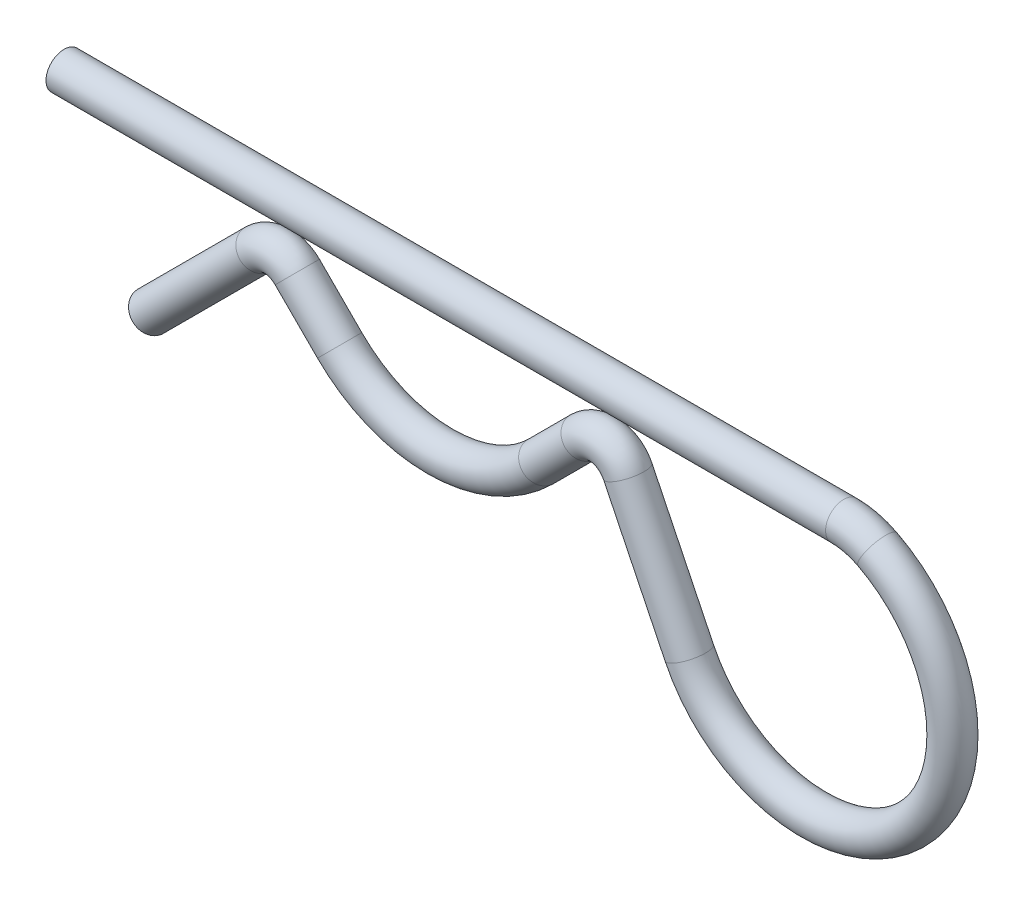
ISO-10303-21;
HEADER;
FILE_DESCRIPTION(('STEP AP214'),'2;1');
FILE_NAME('part.step','',(''),(''),'','','');
FILE_SCHEMA(('AUTOMOTIVE_DESIGN { 1 0 10303 214 1 1 1 1 }'));
ENDSEC;
DATA;
#1=APPLICATION_CONTEXT('core data for automotive mechanical design processes');
#2=APPLICATION_PROTOCOL_DEFINITION('international standard','automotive_design',2000,#1);
#3=PRODUCT_CONTEXT('',#1,'mechanical');
#4=PRODUCT('Part','Part','',(#3));
#5=PRODUCT_RELATED_PRODUCT_CATEGORY('part','',(#4));
#6=PRODUCT_DEFINITION_FORMATION('','',#4);
#7=PRODUCT_DEFINITION_CONTEXT('part definition',#1,'design');
#8=PRODUCT_DEFINITION('design','',#6,#7);
#9=PRODUCT_DEFINITION_SHAPE('','',#8);
#10=(LENGTH_UNIT() NAMED_UNIT(*) SI_UNIT(.MILLI.,.METRE.));
#11=(NAMED_UNIT(*) PLANE_ANGLE_UNIT() SI_UNIT($,.RADIAN.));
#12=(NAMED_UNIT(*) SI_UNIT($,.STERADIAN.) SOLID_ANGLE_UNIT());
#13=UNCERTAINTY_MEASURE_WITH_UNIT(LENGTH_MEASURE(1.E-05),#10,'distance_accuracy_value','');
#14=(GEOMETRIC_REPRESENTATION_CONTEXT(3) GLOBAL_UNCERTAINTY_ASSIGNED_CONTEXT((#13)) GLOBAL_UNIT_ASSIGNED_CONTEXT((#10,
#11,#12)) REPRESENTATION_CONTEXT('',''));
#15=CARTESIAN_POINT('',(0.,0.,0.));
#16=DIRECTION('',(0.,0.,1.));
#17=DIRECTION('',(1.,0.,0.));
#18=AXIS2_PLACEMENT_3D('',#15,#16,#17);
#19=CARTESIAN_POINT('',(-12.5950175273646,-4.02199183051922,0.));
#20=DIRECTION('',(-0.707106781186551,-0.707106781186544,0.));
#21=DIRECTION('',(0.707106781186544,-0.707106781186551,0.));
#22=AXIS2_PLACEMENT_3D('',#19,#20,#21);
#23=CYLINDRICAL_SURFACE('',#22,1.25);
#24=CARTESIAN_POINT('',(-12.5950175273646,-4.02199183051922,0.));
#25=DIRECTION('',(0.707106781186678,0.707106781186417,0.));
#26=DIRECTION('',(-0.707106781186417,0.707106781186678,0.));
#27=AXIS2_PLACEMENT_3D('',#24,#25,#26);
#28=CIRCLE('',#27,1.25);
#29=CARTESIAN_POINT('',(-13.4789010038478,-3.13810835403603,0.));
#30=VERTEX_POINT('',#29);
#31=EDGE_CURVE('E37',#30,#30,#28,.T.);
#32=ORIENTED_EDGE('',*,*,#31,.F.);
#33=EDGE_LOOP('',(#32));
#34=FACE_BOUND('',#33,.T.);
#35=CARTESIAN_POINT('',(-20.0132029763646,-11.4401772795191,0.));
#36=DIRECTION('',(0.707106781186678,0.707106781186417,0.));
#37=DIRECTION('',(-0.707106781186417,0.707106781186678,0.));
#38=AXIS2_PLACEMENT_3D('',#35,#36,#37);
#39=CIRCLE('',#38,1.25);
#40=CARTESIAN_POINT('',(-20.8970864528476,-10.5562938030358,0.));
#41=VERTEX_POINT('',#40);
#42=EDGE_CURVE('E10',#41,#41,#39,.T.);
#43=ORIENTED_EDGE('',*,*,#42,.T.);
#44=EDGE_LOOP('',(#43));
#45=FACE_BOUND('',#44,.T.);
#46=ADVANCED_FACE('F31',(#34,#45),#23,.T.);
#47=CARTESIAN_POINT('',(-11.2372220859959,-5.37978727188797,0.));
#48=DIRECTION('',(0.,0.,1.));
#49=DIRECTION('',(1.,0.,0.));
#50=AXIS2_PLACEMENT_3D('',#47,#48,#49);
#51=TOROIDAL_SURFACE('',#50,1.92021272811202,1.25);
#52=CARTESIAN_POINT('',(-9.87942664462724,-4.02199183051914,0.));
#53=DIRECTION('',(0.707106781186474,-0.707106781186621,0.));
#54=DIRECTION('',(0.707106781186621,0.707106781186474,0.));
#55=AXIS2_PLACEMENT_3D('',#52,#53,#54);
#56=CIRCLE('',#55,1.25);
#57=CARTESIAN_POINT('',(-8.99554316814412,-3.1381083540359,0.));
#58=VERTEX_POINT('',#57);
#59=EDGE_CURVE('E41',#58,#58,#56,.T.);
#60=CARTESIAN_POINT('',(-11.2372220859959,-5.37978727188797,0.));
#61=DIRECTION('',(0.,0.,1.));
#62=DIRECTION('',(1.,0.,0.));
#63=AXIS2_PLACEMENT_3D('',#60,#61,#62);
#64=CIRCLE('',#63,3.17021272811202);
#65=EDGE_CURVE('',#58,#30,#64,.T.);
#66=ORIENTED_EDGE('',*,*,#59,.F.);
#67=ORIENTED_EDGE('',*,*,#31,.T.);
#68=ORIENTED_EDGE('',*,*,#65,.T.);
#69=ORIENTED_EDGE('',*,*,#65,.F.);
#70=EDGE_LOOP('',(#66,#68,#67,#69));
#71=FACE_BOUND('',#70,.T.);
#72=ADVANCED_FACE('F90',(#71),#51,.T.);
#73=CARTESIAN_POINT('',(-6.95070923757332,-6.95070923757309,0.));
#74=DIRECTION('',(-0.707106781186544,0.707106781186551,0.));
#75=DIRECTION('',(-0.707106781186551,-0.707106781186544,0.));
#76=AXIS2_PLACEMENT_3D('',#73,#74,#75);
#77=CYLINDRICAL_SURFACE('',#76,1.25);
#78=CARTESIAN_POINT('',(-6.95070923757332,-6.95070923757309,0.));
#79=DIRECTION('',(0.707106781186474,-0.707106781186621,0.));
#80=DIRECTION('',(0.707106781186621,0.707106781186474,0.));
#81=AXIS2_PLACEMENT_3D('',#78,#79,#80);
#82=CIRCLE('',#81,1.25);
#83=CARTESIAN_POINT('',(-7.83459271405652,-7.83459271405626,0.));
#84=VERTEX_POINT('',#83);
#85=EDGE_CURVE('E45',#84,#84,#82,.T.);
#86=ORIENTED_EDGE('',*,*,#85,.F.);
#87=EDGE_LOOP('',(#86));
#88=FACE_BOUND('',#87,.T.);
#89=ORIENTED_EDGE('',*,*,#59,.T.);
#90=EDGE_LOOP('',(#89));
#91=FACE_BOUND('',#90,.T.);
#92=ADVANCED_FACE('F95',(#88,#91),#77,.T.);
#93=CARTESIAN_POINT('',(0.,0.,0.));
#94=DIRECTION('',(0.,0.,-1.));
#95=DIRECTION('',(-1.,0.,0.));
#96=AXIS2_PLACEMENT_3D('',#93,#94,#95);
#97=TOROIDAL_SURFACE('',#96,9.82978727188798,1.25);
#98=CARTESIAN_POINT('',(6.9507092375734,-6.95070923757301,0.));
#99=DIRECTION('',(0.707106781186589,0.707106781186507,0.));
#100=DIRECTION('',(-0.707106781186507,0.707106781186589,0.));
#101=AXIS2_PLACEMENT_3D('',#98,#99,#100);
#102=CIRCLE('',#101,1.25);
#103=CARTESIAN_POINT('',(7.83459271405661,-7.83459271405616,0.));
#104=VERTEX_POINT('',#103);
#105=EDGE_CURVE('E50',#104,#104,#102,.T.);
#106=CARTESIAN_POINT('',(0.,0.,0.));
#107=DIRECTION('',(0.,0.,-1.));
#108=DIRECTION('',(-1.,0.,0.));
#109=AXIS2_PLACEMENT_3D('',#106,#107,#108);
#110=CIRCLE('',#109,11.079787271888);
#111=EDGE_CURVE('',#104,#84,#110,.T.);
#112=ORIENTED_EDGE('',*,*,#105,.F.);
#113=ORIENTED_EDGE('',*,*,#85,.T.);
#114=ORIENTED_EDGE('',*,*,#111,.T.);
#115=ORIENTED_EDGE('',*,*,#111,.F.);
#116=EDGE_LOOP('',(#112,#114,#113,#115));
#117=FACE_BOUND('',#116,.T.);
#118=ADVANCED_FACE('F100',(#117),#97,.T.);
#119=CARTESIAN_POINT('',(9.87942664462694,-4.02199183051935,0.));
#120=DIRECTION('',(-0.707106781186533,-0.707106781186562,0.));
#121=DIRECTION('',(0.707106781186562,-0.707106781186533,0.));
#122=AXIS2_PLACEMENT_3D('',#119,#120,#121);
#123=CYLINDRICAL_SURFACE('',#122,1.25);
#124=CARTESIAN_POINT('',(9.87942664462694,-4.02199183051935,0.));
#125=DIRECTION('',(0.707106781186589,0.707106781186507,0.));
#126=DIRECTION('',(-0.707106781186507,0.707106781186589,0.));
#127=AXIS2_PLACEMENT_3D('',#124,#125,#126);
#128=CIRCLE('',#127,1.25);
#129=CARTESIAN_POINT('',(8.9955431681437,-3.13810835403622,0.));
#130=VERTEX_POINT('',#129);
#131=EDGE_CURVE('E53',#130,#130,#128,.T.);
#132=ORIENTED_EDGE('',*,*,#131,.F.);
#133=EDGE_LOOP('',(#132));
#134=FACE_BOUND('',#133,.T.);
#135=ORIENTED_EDGE('',*,*,#105,.T.);
#136=EDGE_LOOP('',(#135));
#137=FACE_BOUND('',#136,.T.);
#138=ADVANCED_FACE('F107',(#134,#137),#123,.T.);
#139=CARTESIAN_POINT('',(11.2372220859957,-5.37978727188797,0.));
#140=DIRECTION('',(0.,0.,1.));
#141=DIRECTION('',(1.,0.,0.));
#142=AXIS2_PLACEMENT_3D('',#139,#140,#141);
#143=TOROIDAL_SURFACE('',#142,1.92021272811198,1.25);
#144=CARTESIAN_POINT('',(12.9638214158609,-4.53950655967789,0.));
#145=DIRECTION('',(0.437597720246371,-0.899170859867678,0.));
#146=DIRECTION('',(0.899170859867678,0.437597720246371,0.));
#147=AXIS2_PLACEMENT_3D('',#144,#145,#146);
#148=CIRCLE('',#147,1.25);
#149=CARTESIAN_POINT('',(14.0877849906955,-3.9925094093698,0.));
#150=VERTEX_POINT('',#149);
#151=EDGE_CURVE('E56',#150,#150,#148,.T.);
#152=CARTESIAN_POINT('',(11.2372220859957,-5.37978727188797,0.));
#153=DIRECTION('',(0.,0.,1.));
#154=DIRECTION('',(1.,0.,0.));
#155=AXIS2_PLACEMENT_3D('',#152,#153,#154);
#156=CIRCLE('',#155,3.17021272811198);
#157=EDGE_CURVE('',#150,#130,#156,.T.);
#158=ORIENTED_EDGE('',*,*,#151,.F.);
#159=ORIENTED_EDGE('',*,*,#131,.T.);
#160=ORIENTED_EDGE('',*,*,#157,.T.);
#161=ORIENTED_EDGE('',*,*,#157,.F.);
#162=EDGE_LOOP('',(#158,#160,#159,#161));
#163=FACE_BOUND('',#162,.T.);
#164=ADVANCED_FACE('F111',(#163),#143,.T.);
#165=CARTESIAN_POINT('',(17.2135886517226,-13.2718803425113,0.));
#166=DIRECTION('',(-0.437597720246381,0.899170859867673,0.));
#167=DIRECTION('',(-0.899170859867673,-0.437597720246381,0.));
#168=AXIS2_PLACEMENT_3D('',#165,#166,#167);
#169=CYLINDRICAL_SURFACE('',#168,1.25);
#170=CARTESIAN_POINT('',(17.2135886517226,-13.2718803425113,0.));
#171=DIRECTION('',(0.437597720246371,-0.899170859867678,0.));
#172=DIRECTION('',(0.899170859867678,0.437597720246371,0.));
#173=AXIS2_PLACEMENT_3D('',#170,#171,#172);
#174=CIRCLE('',#173,1.25);
#175=CARTESIAN_POINT('',(16.089625076888,-13.8188774928192,0.));
#176=VERTEX_POINT('',#175);
#177=EDGE_CURVE('E59',#176,#176,#174,.T.);
#178=ORIENTED_EDGE('',*,*,#177,.F.);
#179=EDGE_LOOP('',(#178));
#180=FACE_BOUND('',#179,.T.);
#181=ORIENTED_EDGE('',*,*,#151,.T.);
#182=EDGE_LOOP('',(#181));
#183=FACE_BOUND('',#182,.T.);
#184=ADVANCED_FACE('F115',(#180,#183),#169,.T.);
#185=CARTESIAN_POINT('',(25.8274542103356,-9.07978727188788,0.));
#186=DIRECTION('',(0.,0.,-1.));
#187=DIRECTION('',(-1.,0.,0.));
#188=AXIS2_PLACEMENT_3D('',#185,#186,#187);
#189=TOROIDAL_SURFACE('',#188,9.57978727188806,1.25);
#190=CARTESIAN_POINT('',(30.2161736317736,-0.564420807987381,0.));
#191=DIRECTION('',(-0.88888888888889,0.458122847290849,0.));
#192=DIRECTION('',(-0.458122847290849,-0.88888888888889,0.));
#193=AXIS2_PLACEMENT_3D('',#190,#191,#192);
#194=CIRCLE('',#193,1.25);
#195=CARTESIAN_POINT('',(30.7888271908872,0.54669030312373,0.));
#196=VERTEX_POINT('',#195);
#197=EDGE_CURVE('E62',#196,#196,#194,.T.);
#198=CARTESIAN_POINT('',(25.8274542103356,-9.07978727188788,0.));
#199=DIRECTION('',(0.,0.,-1.));
#200=DIRECTION('',(-1.,0.,0.));
#201=AXIS2_PLACEMENT_3D('',#198,#199,#200);
#202=CIRCLE('',#201,10.8297872718881);
#203=EDGE_CURVE('',#196,#176,#202,.T.);
#204=ORIENTED_EDGE('',*,*,#197,.F.);
#205=ORIENTED_EDGE('',*,*,#177,.T.);
#206=ORIENTED_EDGE('',*,*,#203,.T.);
#207=ORIENTED_EDGE('',*,*,#203,.F.);
#208=EDGE_LOOP('',(#204,#206,#205,#207));
#209=FACE_BOUND('',#208,.T.);
#210=ADVANCED_FACE('F86',(#209),#189,.T.);
#211=CARTESIAN_POINT('',(27.8890070231446,-5.07978727188797,0.));
#212=DIRECTION('',(0.,0.,-1.));
#213=DIRECTION('',(-1.,0.,0.));
#214=AXIS2_PLACEMENT_3D('',#211,#212,#213);
#215=TOROIDAL_SURFACE('',#214,5.07978727188804,1.25);
#216=CARTESIAN_POINT('',(27.8890070231444,0.,0.));
#217=DIRECTION('',(-1.,0.,0.));
#218=DIRECTION('',(0.,-1.,0.));
#219=AXIS2_PLACEMENT_3D('',#216,#217,#218);
#220=CIRCLE('',#219,1.25);
#221=CARTESIAN_POINT('',(27.8890070231444,1.25000000000007,0.));
#222=VERTEX_POINT('',#221);
#223=EDGE_CURVE('E65',#222,#222,#220,.T.);
#224=CARTESIAN_POINT('',(27.8890070231446,-5.07978727188797,0.));
#225=DIRECTION('',(0.,0.,-1.));
#226=DIRECTION('',(-1.,0.,0.));
#227=AXIS2_PLACEMENT_3D('',#224,#225,#226);
#228=CIRCLE('',#227,6.32978727188804);
#229=EDGE_CURVE('',#222,#196,#228,.T.);
#230=ORIENTED_EDGE('',*,*,#223,.F.);
#231=ORIENTED_EDGE('',*,*,#197,.T.);
#232=ORIENTED_EDGE('',*,*,#229,.T.);
#233=ORIENTED_EDGE('',*,*,#229,.F.);
#234=EDGE_LOOP('',(#230,#232,#231,#233));
#235=FACE_BOUND('',#234,.T.);
#236=ADVANCED_FACE('F77',(#235),#215,.T.);
#237=CARTESIAN_POINT('',(27.8890070231444,0.,0.));
#238=DIRECTION('',(-1.,0.,0.));
#239=DIRECTION('',(0.,-1.,0.));
#240=AXIS2_PLACEMENT_3D('',#237,#238,#239);
#241=CYLINDRICAL_SURFACE('',#240,1.25);
#242=ORIENTED_EDGE('',*,*,#223,.T.);
#243=EDGE_LOOP('',(#242));
#244=FACE_BOUND('',#243,.T.);
#245=CARTESIAN_POINT('',(-26.,0.,0.));
#246=DIRECTION('',(-1.,0.,0.));
#247=DIRECTION('',(0.,-1.,0.));
#248=AXIS2_PLACEMENT_3D('',#245,#246,#247);
#249=CIRCLE('',#248,1.25);
#250=CARTESIAN_POINT('',(-26.,-1.25000000000002,0.));
#251=VERTEX_POINT('',#250);
#252=EDGE_CURVE('E68',#251,#251,#249,.T.);
#253=ORIENTED_EDGE('',*,*,#252,.F.);
#254=EDGE_LOOP('',(#253));
#255=FACE_BOUND('',#254,.T.);
#256=ADVANCED_FACE('F74',(#244,#255),#241,.T.);
#257=CARTESIAN_POINT('',(-20.0132029763646,-11.4401772795191,0.));
#258=DIRECTION('',(0.707106781186678,0.707106781186417,0.));
#259=DIRECTION('',(-0.707106781186417,0.707106781186678,0.));
#260=AXIS2_PLACEMENT_3D('',#257,#258,#259);
#261=PLANE('',#260);
#262=ORIENTED_EDGE('',*,*,#42,.F.);
#263=EDGE_LOOP('',(#262));
#264=FACE_BOUND('',#263,.T.);
#265=ADVANCED_FACE('F76',(#264),#261,.F.);
#266=CARTESIAN_POINT('',(-26.,0.,0.));
#267=DIRECTION('',(-1.,0.,0.));
#268=DIRECTION('',(0.,-1.,0.));
#269=AXIS2_PLACEMENT_3D('',#266,#267,#268);
#270=PLANE('',#269);
#271=ORIENTED_EDGE('',*,*,#252,.T.);
#272=EDGE_LOOP('',(#271));
#273=FACE_BOUND('',#272,.T.);
#274=ADVANCED_FACE('F72',(#273),#270,.T.);
#275=CLOSED_SHELL('',(#46,#72,#92,#118,#138,#164,#184,#210,#236,#256,#265,#274));
#276=MANIFOLD_SOLID_BREP('B2',#275);
#277=ADVANCED_BREP_SHAPE_REPRESENTATION('',(#18,#276),#14);
#278=SHAPE_DEFINITION_REPRESENTATION(#9,#277);
ENDSEC;
END-ISO-10303-21;
